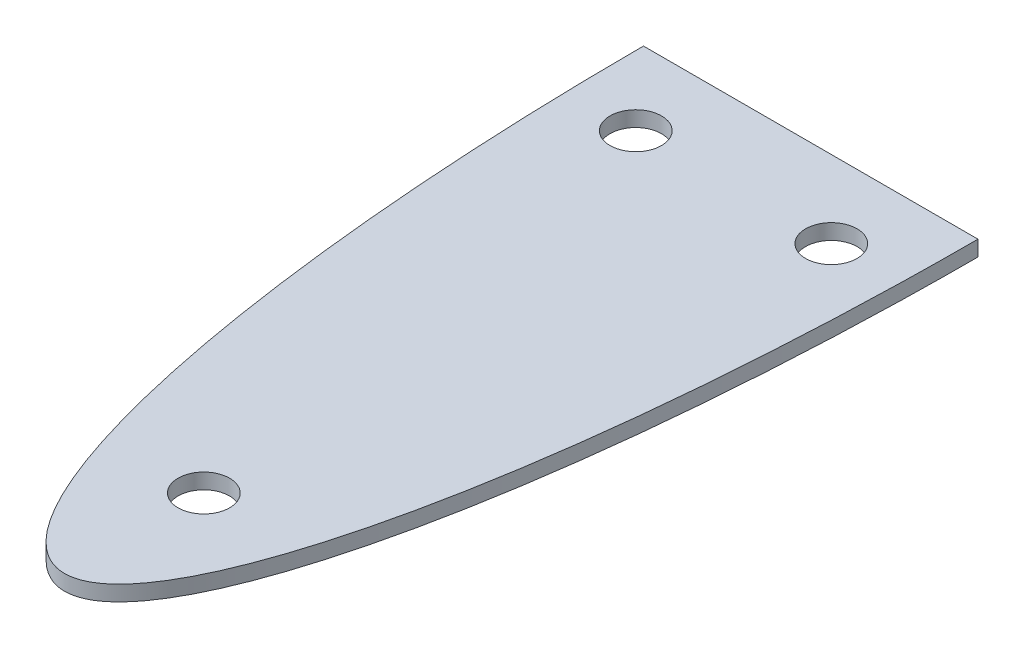
ISO-10303-21;
HEADER;
FILE_DESCRIPTION(('STEP AP214'),'2;1');
FILE_NAME('part.step','',(''),(''),'','','');
FILE_SCHEMA(('AUTOMOTIVE_DESIGN { 1 0 10303 214 1 1 1 1 }'));
ENDSEC;
DATA;
#1=APPLICATION_CONTEXT('core data for automotive mechanical design processes');
#2=APPLICATION_PROTOCOL_DEFINITION('international standard','automotive_design',2000,#1);
#3=PRODUCT_CONTEXT('',#1,'mechanical');
#4=PRODUCT('Part','Part','',(#3));
#5=PRODUCT_RELATED_PRODUCT_CATEGORY('part','',(#4));
#6=PRODUCT_DEFINITION_FORMATION('','',#4);
#7=PRODUCT_DEFINITION_CONTEXT('part definition',#1,'design');
#8=PRODUCT_DEFINITION('design','',#6,#7);
#9=PRODUCT_DEFINITION_SHAPE('','',#8);
#10=(LENGTH_UNIT() NAMED_UNIT(*) SI_UNIT(.MILLI.,.METRE.));
#11=(NAMED_UNIT(*) PLANE_ANGLE_UNIT() SI_UNIT($,.RADIAN.));
#12=(NAMED_UNIT(*) SI_UNIT($,.STERADIAN.) SOLID_ANGLE_UNIT());
#13=UNCERTAINTY_MEASURE_WITH_UNIT(LENGTH_MEASURE(1.E-05),#10,'distance_accuracy_value','');
#14=(GEOMETRIC_REPRESENTATION_CONTEXT(3) GLOBAL_UNCERTAINTY_ASSIGNED_CONTEXT((#13)) GLOBAL_UNIT_ASSIGNED_CONTEXT((#10,
#11,#12)) REPRESENTATION_CONTEXT('',''));
#15=CARTESIAN_POINT('',(0.,0.,0.));
#16=DIRECTION('',(0.,0.,1.));
#17=DIRECTION('',(1.,0.,0.));
#18=AXIS2_PLACEMENT_3D('',#15,#16,#17);
#19=CARTESIAN_POINT('',(0.,3.,0.));
#20=DIRECTION('',(0.,1.,0.));
#21=DIRECTION('',(0.,0.,-1.));
#22=AXIS2_PLACEMENT_3D('',#19,#20,#21);
#23=ELLIPSE('',#22,145.,32.5);
#24=DIRECTION('',(0.,-1.,0.));
#25=VECTOR('',#24,1.);
#26=SURFACE_OF_LINEAR_EXTRUSION('',#23,#25);
#27=CARTESIAN_POINT('',(0.,0.,0.));
#28=DIRECTION('',(0.,1.,0.));
#29=DIRECTION('',(0.,0.,-1.));
#30=AXIS2_PLACEMENT_3D('',#27,#28,#29);
#31=ELLIPSE('',#30,145.,32.5);
#32=CARTESIAN_POINT('',(-32.5,0.,0.));
#33=VERTEX_POINT('',#32);
#34=CARTESIAN_POINT('',(32.5,0.,0.));
#35=VERTEX_POINT('',#34);
#36=EDGE_CURVE('E72',#33,#35,#31,.T.);
#37=ORIENTED_EDGE('',*,*,#36,.T.);
#38=DIRECTION('',(0.,-1.,0.));
#39=VECTOR('',#38,1.);
#40=CARTESIAN_POINT('',(32.5,3.,0.));
#41=LINE('',#40,#39);
#42=CARTESIAN_POINT('',(32.5,3.,0.));
#43=VERTEX_POINT('',#42);
#44=EDGE_CURVE('E11',#43,#35,#41,.T.);
#45=ORIENTED_EDGE('',*,*,#44,.F.);
#46=CARTESIAN_POINT('',(-32.5,3.,0.));
#47=VERTEX_POINT('',#46);
#48=EDGE_CURVE('E71',#47,#43,#23,.T.);
#49=ORIENTED_EDGE('',*,*,#48,.F.);
#50=DIRECTION('',(0.,-1.,0.));
#51=VECTOR('',#50,1.);
#52=CARTESIAN_POINT('',(-32.5,3.,0.));
#53=LINE('',#52,#51);
#54=EDGE_CURVE('E49',#47,#33,#53,.T.);
#55=ORIENTED_EDGE('',*,*,#54,.T.);
#56=EDGE_LOOP('',(#37,#45,#49,#55));
#57=FACE_BOUND('',#56,.T.);
#58=ADVANCED_FACE('F40',(#57),#26,.F.);
#59=CARTESIAN_POINT('',(-32.5,3.,0.));
#60=DIRECTION('',(0.,0.,1.));
#61=DIRECTION('',(1.,0.,0.));
#62=AXIS2_PLACEMENT_3D('',#59,#60,#61);
#63=PLANE('',#62);
#64=DIRECTION('',(-1.,0.,0.));
#65=VECTOR('',#64,1.);
#66=CARTESIAN_POINT('',(-32.5,0.,0.));
#67=LINE('',#66,#65);
#68=EDGE_CURVE('E64',#35,#33,#67,.T.);
#69=ORIENTED_EDGE('',*,*,#68,.T.);
#70=ORIENTED_EDGE('',*,*,#54,.F.);
#71=DIRECTION('',(-1.,0.,0.));
#72=VECTOR('',#71,1.);
#73=CARTESIAN_POINT('',(-32.5,3.,0.));
#74=LINE('',#73,#72);
#75=EDGE_CURVE('E56',#43,#47,#74,.T.);
#76=ORIENTED_EDGE('',*,*,#75,.F.);
#77=ORIENTED_EDGE('',*,*,#44,.T.);
#78=EDGE_LOOP('',(#69,#70,#76,#77));
#79=FACE_BOUND('',#78,.T.);
#80=ADVANCED_FACE('F67',(#79),#63,.F.);
#81=CARTESIAN_POINT('',(0.,3.,0.));
#82=DIRECTION('',(0.,1.,0.));
#83=DIRECTION('',(0.,0.,1.));
#84=AXIS2_PLACEMENT_3D('',#81,#82,#83);
#85=PLANE('',#84);
#86=CARTESIAN_POINT('',(-19.,3.,15.));
#87=DIRECTION('',(0.,1.,0.));
#88=DIRECTION('',(0.,0.,1.));
#89=AXIS2_PLACEMENT_3D('',#86,#87,#88);
#90=CIRCLE('',#89,5.);
#91=CARTESIAN_POINT('',(-19.,3.,20.));
#92=VERTEX_POINT('',#91);
#93=EDGE_CURVE('E79',#92,#92,#90,.T.);
#94=ORIENTED_EDGE('',*,*,#93,.F.);
#95=EDGE_LOOP('',(#94));
#96=FACE_BOUND('',#95,.T.);
#97=CARTESIAN_POINT('',(0.,3.,117.924839081906));
#98=DIRECTION('',(0.,1.,0.));
#99=DIRECTION('',(0.,0.,1.));
#100=AXIS2_PLACEMENT_3D('',#97,#98,#99);
#101=CIRCLE('',#100,5.);
#102=CARTESIAN_POINT('',(0.,3.,122.924839081906));
#103=VERTEX_POINT('',#102);
#104=EDGE_CURVE('E93',#103,#103,#101,.T.);
#105=ORIENTED_EDGE('',*,*,#104,.F.);
#106=EDGE_LOOP('',(#105));
#107=FACE_BOUND('',#106,.T.);
#108=CARTESIAN_POINT('',(19.,3.,14.9999999999999));
#109=DIRECTION('',(0.,1.,0.));
#110=DIRECTION('',(0.,0.,-1.));
#111=AXIS2_PLACEMENT_3D('',#108,#109,#110);
#112=CIRCLE('',#111,5.);
#113=CARTESIAN_POINT('',(19.,3.,9.99999999999995));
#114=VERTEX_POINT('',#113);
#115=EDGE_CURVE('E87',#114,#114,#112,.T.);
#116=ORIENTED_EDGE('',*,*,#115,.F.);
#117=EDGE_LOOP('',(#116));
#118=FACE_BOUND('',#117,.T.);
#119=ORIENTED_EDGE('',*,*,#48,.T.);
#120=ORIENTED_EDGE('',*,*,#75,.T.);
#121=EDGE_LOOP('',(#119,#120));
#122=FACE_BOUND('',#121,.T.);
#123=ADVANCED_FACE('F101',(#96,#107,#118,#122),#85,.T.);
#124=CARTESIAN_POINT('',(0.,0.,0.));
#125=DIRECTION('',(0.,1.,0.));
#126=DIRECTION('',(0.,0.,1.));
#127=AXIS2_PLACEMENT_3D('',#124,#125,#126);
#128=PLANE('',#127);
#129=CARTESIAN_POINT('',(-19.,0.,15.));
#130=DIRECTION('',(0.,1.,0.));
#131=DIRECTION('',(0.,0.,1.));
#132=AXIS2_PLACEMENT_3D('',#129,#130,#131);
#133=CIRCLE('',#132,5.);
#134=CARTESIAN_POINT('',(-19.,0.,20.));
#135=VERTEX_POINT('',#134);
#136=EDGE_CURVE('E76',#135,#135,#133,.T.);
#137=ORIENTED_EDGE('',*,*,#136,.T.);
#138=EDGE_LOOP('',(#137));
#139=FACE_BOUND('',#138,.T.);
#140=CARTESIAN_POINT('',(0.,0.,117.924839081906));
#141=DIRECTION('',(0.,1.,0.));
#142=DIRECTION('',(0.,0.,1.));
#143=AXIS2_PLACEMENT_3D('',#140,#141,#142);
#144=CIRCLE('',#143,5.);
#145=CARTESIAN_POINT('',(0.,0.,122.924839081906));
#146=VERTEX_POINT('',#145);
#147=EDGE_CURVE('E90',#146,#146,#144,.T.);
#148=ORIENTED_EDGE('',*,*,#147,.T.);
#149=EDGE_LOOP('',(#148));
#150=FACE_BOUND('',#149,.T.);
#151=CARTESIAN_POINT('',(19.,0.,14.9999999999999));
#152=DIRECTION('',(0.,1.,0.));
#153=DIRECTION('',(0.,0.,-1.));
#154=AXIS2_PLACEMENT_3D('',#151,#152,#153);
#155=CIRCLE('',#154,5.);
#156=CARTESIAN_POINT('',(19.,0.,9.99999999999995));
#157=VERTEX_POINT('',#156);
#158=EDGE_CURVE('E84',#157,#157,#155,.T.);
#159=ORIENTED_EDGE('',*,*,#158,.T.);
#160=EDGE_LOOP('',(#159));
#161=FACE_BOUND('',#160,.T.);
#162=ORIENTED_EDGE('',*,*,#36,.F.);
#163=ORIENTED_EDGE('',*,*,#68,.F.);
#164=EDGE_LOOP('',(#162,#163));
#165=FACE_BOUND('',#164,.T.);
#166=ADVANCED_FACE('F75',(#139,#150,#161,#165),#128,.F.);
#167=CARTESIAN_POINT('',(19.,0.,14.9999999999999));
#168=DIRECTION('',(0.,1.,0.));
#169=DIRECTION('',(0.,0.,1.));
#170=AXIS2_PLACEMENT_3D('',#167,#168,#169);
#171=CYLINDRICAL_SURFACE('',#170,5.);
#172=ORIENTED_EDGE('',*,*,#158,.F.);
#173=EDGE_LOOP('',(#172));
#174=FACE_BOUND('',#173,.T.);
#175=ORIENTED_EDGE('',*,*,#115,.T.);
#176=EDGE_LOOP('',(#175));
#177=FACE_BOUND('',#176,.T.);
#178=ADVANCED_FACE('F109',(#174,#177),#171,.F.);
#179=CARTESIAN_POINT('',(0.,0.,117.924839081906));
#180=DIRECTION('',(0.,1.,0.));
#181=DIRECTION('',(0.,0.,1.));
#182=AXIS2_PLACEMENT_3D('',#179,#180,#181);
#183=CYLINDRICAL_SURFACE('',#182,5.);
#184=ORIENTED_EDGE('',*,*,#147,.F.);
#185=EDGE_LOOP('',(#184));
#186=FACE_BOUND('',#185,.T.);
#187=ORIENTED_EDGE('',*,*,#104,.T.);
#188=EDGE_LOOP('',(#187));
#189=FACE_BOUND('',#188,.T.);
#190=ADVANCED_FACE('F111',(#186,#189),#183,.F.);
#191=CARTESIAN_POINT('',(-19.,0.,15.));
#192=DIRECTION('',(0.,1.,0.));
#193=DIRECTION('',(0.,0.,1.));
#194=AXIS2_PLACEMENT_3D('',#191,#192,#193);
#195=CYLINDRICAL_SURFACE('',#194,5.);
#196=ORIENTED_EDGE('',*,*,#136,.F.);
#197=EDGE_LOOP('',(#196));
#198=FACE_BOUND('',#197,.T.);
#199=ORIENTED_EDGE('',*,*,#93,.T.);
#200=EDGE_LOOP('',(#199));
#201=FACE_BOUND('',#200,.T.);
#202=ADVANCED_FACE('F99',(#198,#201),#195,.F.);
#203=CLOSED_SHELL('',(#58,#80,#123,#166,#178,#190,#202));
#204=MANIFOLD_SOLID_BREP('B2',#203);
#205=ADVANCED_BREP_SHAPE_REPRESENTATION('',(#18,#204),#14);
#206=SHAPE_DEFINITION_REPRESENTATION(#9,#205);
ENDSEC;
END-ISO-10303-21;
